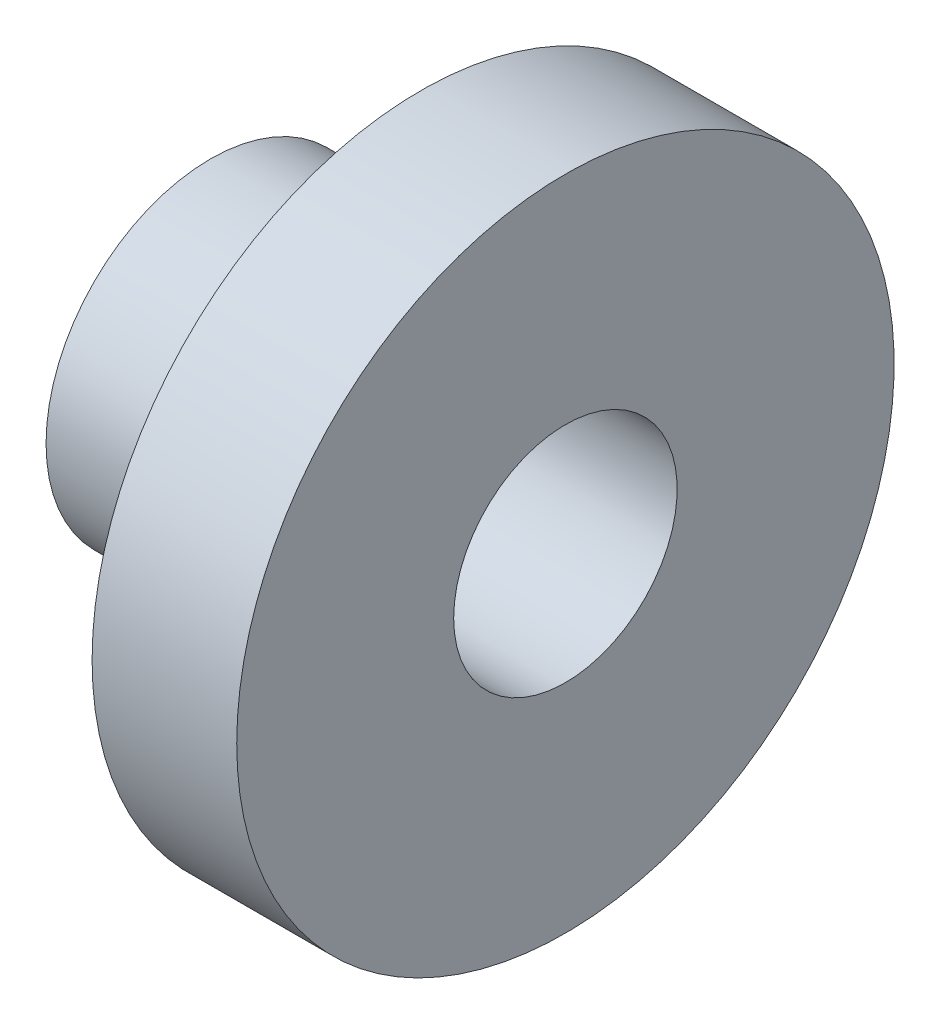
ISO-10303-21;
HEADER;
FILE_DESCRIPTION(('STEP AP214'),'2;1');
FILE_NAME('part.step','',(''),(''),'','','');
FILE_SCHEMA(('AUTOMOTIVE_DESIGN { 1 0 10303 214 1 1 1 1 }'));
ENDSEC;
DATA;
#1=APPLICATION_CONTEXT('core data for automotive mechanical design processes');
#2=APPLICATION_PROTOCOL_DEFINITION('international standard','automotive_design',2000,#1);
#3=PRODUCT_CONTEXT('',#1,'mechanical');
#4=PRODUCT('Part','Part','',(#3));
#5=PRODUCT_RELATED_PRODUCT_CATEGORY('part','',(#4));
#6=PRODUCT_DEFINITION_FORMATION('','',#4);
#7=PRODUCT_DEFINITION_CONTEXT('part definition',#1,'design');
#8=PRODUCT_DEFINITION('design','',#6,#7);
#9=PRODUCT_DEFINITION_SHAPE('','',#8);
#10=(LENGTH_UNIT() NAMED_UNIT(*) SI_UNIT(.MILLI.,.METRE.));
#11=(NAMED_UNIT(*) PLANE_ANGLE_UNIT() SI_UNIT($,.RADIAN.));
#12=(NAMED_UNIT(*) SI_UNIT($,.STERADIAN.) SOLID_ANGLE_UNIT());
#13=UNCERTAINTY_MEASURE_WITH_UNIT(LENGTH_MEASURE(1.E-05),#10,'distance_accuracy_value','');
#14=(GEOMETRIC_REPRESENTATION_CONTEXT(3) GLOBAL_UNCERTAINTY_ASSIGNED_CONTEXT((#13)) GLOBAL_UNIT_ASSIGNED_CONTEXT((#10,
#11,#12)) REPRESENTATION_CONTEXT('',''));
#15=CARTESIAN_POINT('',(0.,0.,0.));
#16=DIRECTION('',(0.,0.,1.));
#17=DIRECTION('',(1.,0.,0.));
#18=AXIS2_PLACEMENT_3D('',#15,#16,#17);
#19=CARTESIAN_POINT('',(-13.5,0.,0.));
#20=DIRECTION('',(1.,0.,0.));
#21=DIRECTION('',(0.,0.,-1.));
#22=AXIS2_PLACEMENT_3D('',#19,#20,#21);
#23=PLANE('',#22);
#24=CARTESIAN_POINT('',(-13.5,0.,0.));
#25=DIRECTION('',(-1.,0.,0.));
#26=DIRECTION('',(0.,0.,1.));
#27=AXIS2_PLACEMENT_3D('',#24,#25,#26);
#28=CIRCLE('',#27,8.5);
#29=CARTESIAN_POINT('',(-13.5,0.,8.5));
#30=VERTEX_POINT('',#29);
#31=EDGE_CURVE('E10',#30,#30,#28,.T.);
#32=ORIENTED_EDGE('',*,*,#31,.F.);
#33=EDGE_LOOP('',(#32));
#34=FACE_BOUND('',#33,.T.);
#35=CARTESIAN_POINT('',(-13.5,0.,0.));
#36=DIRECTION('',(-1.,0.,0.));
#37=DIRECTION('',(0.,0.,1.));
#38=AXIS2_PLACEMENT_3D('',#35,#36,#37);
#39=CIRCLE('',#38,12.5);
#40=CARTESIAN_POINT('',(-13.5,0.,12.5));
#41=VERTEX_POINT('',#40);
#42=EDGE_CURVE('E66',#41,#41,#39,.T.);
#43=ORIENTED_EDGE('',*,*,#42,.T.);
#44=EDGE_LOOP('',(#43));
#45=FACE_BOUND('',#44,.T.);
#46=ADVANCED_FACE('F39',(#34,#45),#23,.F.);
#47=CARTESIAN_POINT('',(-13.5,0.,0.));
#48=DIRECTION('',(-1.,0.,0.));
#49=DIRECTION('',(0.,0.,1.));
#50=AXIS2_PLACEMENT_3D('',#47,#48,#49);
#51=CYLINDRICAL_SURFACE('',#50,8.5);
#52=CARTESIAN_POINT('',(13.5,0.,0.));
#53=DIRECTION('',(-1.,0.,0.));
#54=DIRECTION('',(0.,0.,1.));
#55=AXIS2_PLACEMENT_3D('',#52,#53,#54);
#56=CIRCLE('',#55,8.5);
#57=CARTESIAN_POINT('',(13.5,0.,8.5));
#58=VERTEX_POINT('',#57);
#59=EDGE_CURVE('E46',#58,#58,#56,.T.);
#60=ORIENTED_EDGE('',*,*,#59,.F.);
#61=EDGE_LOOP('',(#60));
#62=FACE_BOUND('',#61,.T.);
#63=ORIENTED_EDGE('',*,*,#31,.T.);
#64=EDGE_LOOP('',(#63));
#65=FACE_BOUND('',#64,.T.);
#66=ADVANCED_FACE('F92',(#62,#65),#51,.F.);
#67=CARTESIAN_POINT('',(13.5,0.,0.));
#68=DIRECTION('',(-1.,0.,0.));
#69=DIRECTION('',(0.,0.,1.));
#70=AXIS2_PLACEMENT_3D('',#67,#68,#69);
#71=PLANE('',#70);
#72=CARTESIAN_POINT('',(13.5,0.,0.));
#73=DIRECTION('',(-1.,0.,0.));
#74=DIRECTION('',(0.,0.,1.));
#75=AXIS2_PLACEMENT_3D('',#72,#73,#74);
#76=CIRCLE('',#75,25.);
#77=CARTESIAN_POINT('',(13.5,0.,25.));
#78=VERTEX_POINT('',#77);
#79=EDGE_CURVE('E51',#78,#78,#76,.T.);
#80=ORIENTED_EDGE('',*,*,#79,.F.);
#81=EDGE_LOOP('',(#80));
#82=FACE_BOUND('',#81,.T.);
#83=ORIENTED_EDGE('',*,*,#59,.T.);
#84=EDGE_LOOP('',(#83));
#85=FACE_BOUND('',#84,.T.);
#86=ADVANCED_FACE('F87',(#82,#85),#71,.F.);
#87=CARTESIAN_POINT('',(-13.5,0.,0.));
#88=DIRECTION('',(-1.,0.,0.));
#89=DIRECTION('',(0.,0.,1.));
#90=AXIS2_PLACEMENT_3D('',#87,#88,#89);
#91=CYLINDRICAL_SURFACE('',#90,25.);
#92=CARTESIAN_POINT('',(2.5,0.,0.));
#93=DIRECTION('',(-1.,0.,0.));
#94=DIRECTION('',(0.,0.,1.));
#95=AXIS2_PLACEMENT_3D('',#92,#93,#94);
#96=CIRCLE('',#95,25.);
#97=CARTESIAN_POINT('',(2.5,0.,25.));
#98=VERTEX_POINT('',#97);
#99=EDGE_CURVE('E56',#98,#98,#96,.T.);
#100=ORIENTED_EDGE('',*,*,#99,.F.);
#101=EDGE_LOOP('',(#100));
#102=FACE_BOUND('',#101,.T.);
#103=ORIENTED_EDGE('',*,*,#79,.T.);
#104=EDGE_LOOP('',(#103));
#105=FACE_BOUND('',#104,.T.);
#106=ADVANCED_FACE('F81',(#102,#105),#91,.T.);
#107=CARTESIAN_POINT('',(2.5,0.,0.));
#108=DIRECTION('',(1.,0.,0.));
#109=DIRECTION('',(0.,0.,-1.));
#110=AXIS2_PLACEMENT_3D('',#107,#108,#109);
#111=PLANE('',#110);
#112=CARTESIAN_POINT('',(2.5,0.,0.));
#113=DIRECTION('',(-1.,0.,0.));
#114=DIRECTION('',(0.,0.,1.));
#115=AXIS2_PLACEMENT_3D('',#112,#113,#114);
#116=CIRCLE('',#115,12.5);
#117=CARTESIAN_POINT('',(2.5,0.,12.5));
#118=VERTEX_POINT('',#117);
#119=EDGE_CURVE('E62',#118,#118,#116,.T.);
#120=ORIENTED_EDGE('',*,*,#119,.F.);
#121=EDGE_LOOP('',(#120));
#122=FACE_BOUND('',#121,.T.);
#123=ORIENTED_EDGE('',*,*,#99,.T.);
#124=EDGE_LOOP('',(#123));
#125=FACE_BOUND('',#124,.T.);
#126=ADVANCED_FACE('F75',(#122,#125),#111,.F.);
#127=CARTESIAN_POINT('',(-13.5,0.,0.));
#128=DIRECTION('',(-1.,0.,0.));
#129=DIRECTION('',(0.,0.,1.));
#130=AXIS2_PLACEMENT_3D('',#127,#128,#129);
#131=CYLINDRICAL_SURFACE('',#130,12.5);
#132=ORIENTED_EDGE('',*,*,#42,.F.);
#133=EDGE_LOOP('',(#132));
#134=FACE_BOUND('',#133,.T.);
#135=ORIENTED_EDGE('',*,*,#119,.T.);
#136=EDGE_LOOP('',(#135));
#137=FACE_BOUND('',#136,.T.);
#138=ADVANCED_FACE('F72',(#134,#137),#131,.T.);
#139=CLOSED_SHELL('',(#46,#66,#86,#106,#126,#138));
#140=MANIFOLD_SOLID_BREP('B2',#139);
#141=ADVANCED_BREP_SHAPE_REPRESENTATION('',(#18,#140),#14);
#142=SHAPE_DEFINITION_REPRESENTATION(#9,#141);
ENDSEC;
END-ISO-10303-21;
